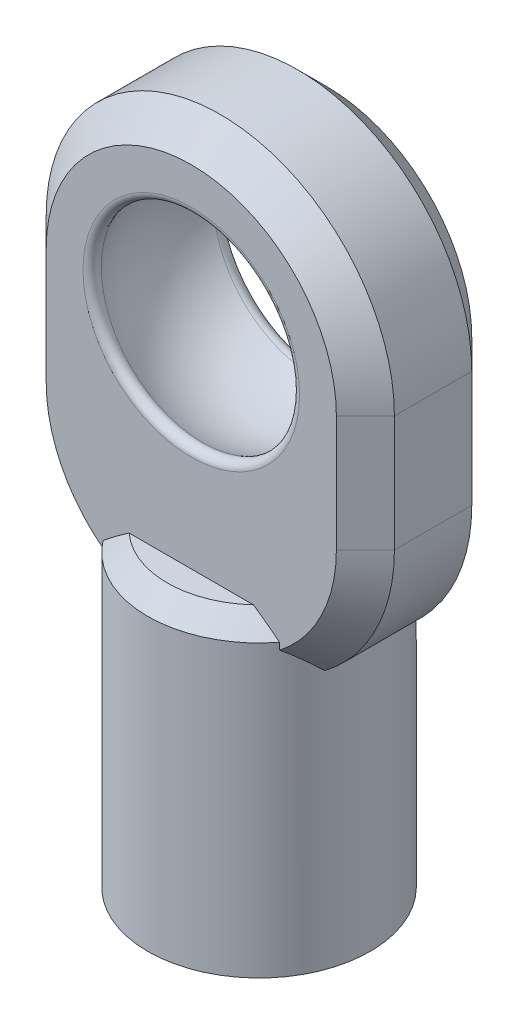
ISO-10303-21;
HEADER;
FILE_DESCRIPTION(('STEP AP214'),'2;1');
FILE_NAME('part.step','',(''),(''),'','','');
FILE_SCHEMA(('AUTOMOTIVE_DESIGN { 1 0 10303 214 1 1 1 1 }'));
ENDSEC;
DATA;
#1=APPLICATION_CONTEXT('core data for automotive mechanical design processes');
#2=APPLICATION_PROTOCOL_DEFINITION('international standard','automotive_design',2000,#1);
#3=PRODUCT_CONTEXT('',#1,'mechanical');
#4=PRODUCT('Part','Part','',(#3));
#5=PRODUCT_RELATED_PRODUCT_CATEGORY('part','',(#4));
#6=PRODUCT_DEFINITION_FORMATION('','',#4);
#7=PRODUCT_DEFINITION_CONTEXT('part definition',#1,'design');
#8=PRODUCT_DEFINITION('design','',#6,#7);
#9=PRODUCT_DEFINITION_SHAPE('','',#8);
#10=(LENGTH_UNIT() NAMED_UNIT(*) SI_UNIT(.MILLI.,.METRE.));
#11=(NAMED_UNIT(*) PLANE_ANGLE_UNIT() SI_UNIT($,.RADIAN.));
#12=(NAMED_UNIT(*) SI_UNIT($,.STERADIAN.) SOLID_ANGLE_UNIT());
#13=UNCERTAINTY_MEASURE_WITH_UNIT(LENGTH_MEASURE(1.E-05),#10,'distance_accuracy_value','');
#14=(GEOMETRIC_REPRESENTATION_CONTEXT(3) GLOBAL_UNCERTAINTY_ASSIGNED_CONTEXT((#13)) GLOBAL_UNIT_ASSIGNED_CONTEXT((#10,
#11,#12)) REPRESENTATION_CONTEXT('',''));
#15=CARTESIAN_POINT('',(0.,0.,0.));
#16=DIRECTION('',(0.,0.,1.));
#17=DIRECTION('',(1.,0.,0.));
#18=AXIS2_PLACEMENT_3D('',#15,#16,#17);
#19=CARTESIAN_POINT('',(0.,13.3,1.75));
#20=DIRECTION('',(0.,0.,-1.));
#21=DIRECTION('',(-1.,0.,0.));
#22=AXIS2_PLACEMENT_3D('',#19,#20,#21);
#23=PLANE('',#22);
#24=CARTESIAN_POINT('',(0.,13.3,1.75));
#25=DIRECTION('',(0.,0.,-1.));
#26=DIRECTION('',(-1.,0.,0.));
#27=AXIS2_PLACEMENT_3D('',#24,#25,#26);
#28=CIRCLE('',#27,2.79955353583388);
#29=CARTESIAN_POINT('',(-2.79955353583388,13.3,1.75));
#30=VERTEX_POINT('',#29);
#31=EDGE_CURVE('E11',#30,#30,#28,.T.);
#32=ORIENTED_EDGE('',*,*,#31,.T.);
#33=EDGE_LOOP('',(#32));
#34=FACE_BOUND('',#33,.T.);
#35=DIRECTION('',(-1.,0.,0.));
#36=VECTOR('',#35,1.);
#37=CARTESIAN_POINT('',(0.,8.,1.75));
#38=LINE('',#37,#36);
#39=CARTESIAN_POINT('',(1.60565407233314,8.,1.75));
#40=VERTEX_POINT('',#39);
#41=CARTESIAN_POINT('',(-1.60565407233314,8.,1.75));
#42=VERTEX_POINT('',#41);
#43=EDGE_CURVE('E265',#40,#42,#38,.T.);
#44=ORIENTED_EDGE('',*,*,#43,.F.);
#45=CARTESIAN_POINT('',(1.60565407233314,8.,1.75));
#46=CARTESIAN_POINT('',(1.6636905404126,7.96074798782015,1.75));
#47=CARTESIAN_POINT('',(1.72119958848667,7.92072909127485,1.75));
#48=CARTESIAN_POINT('',(1.8352846834103,7.8394231765944,1.75));
#49=CARTESIAN_POINT('',(1.89186105440925,7.79813661394961,1.75));
#50=CARTESIAN_POINT('',(2.00423804486126,7.71453695067654,1.75));
#51=CARTESIAN_POINT('',(2.06003874129001,7.67222395306929,1.75));
#52=CARTESIAN_POINT('',(2.17099756657291,7.58672257365775,1.75));
#53=CARTESIAN_POINT('',(2.22615546077587,7.543533887035,1.75));
#54=CARTESIAN_POINT('',(2.28103594886183,7.5,1.75));
#55=B_SPLINE_CURVE_WITH_KNOTS('',3,(#45,#46,#47,#48,#49,#50,#51,#52,#53,#54),.UNSPECIFIED.,.F.,
.F.,(4,2,2,2,4),(0.,0.210175172360645,0.420275689770245,0.630355206391822,0.840509149543498),.UNSPECIFIED.);
#56=CARTESIAN_POINT('',(2.28103594886183,7.5,1.75));
#57=VERTEX_POINT('',#56);
#58=EDGE_CURVE('E39',#40,#57,#55,.T.);
#59=ORIENTED_EDGE('',*,*,#58,.T.);
#60=DIRECTION('',(0.,-1.,0.));
#61=VECTOR('',#60,1.);
#62=CARTESIAN_POINT('',(2.28103594886183,8.,1.75));
#63=LINE('',#62,#61);
#64=CARTESIAN_POINT('',(2.28103594886183,7.32352977505233,1.75));
#65=VERTEX_POINT('',#64);
#66=EDGE_CURVE('E340',#57,#65,#63,.T.);
#67=ORIENTED_EDGE('',*,*,#66,.T.);
#68=CARTESIAN_POINT('',(0.,10.3,1.75));
#69=DIRECTION('',(0.,0.,-1.));
#70=DIRECTION('',(-1.,0.,0.));
#71=AXIS2_PLACEMENT_3D('',#68,#69,#70);
#72=CIRCLE('',#71,3.75);
#73=CARTESIAN_POINT('',(3.75,10.3,1.75));
#74=VERTEX_POINT('',#73);
#75=EDGE_CURVE('E159',#65,#74,#72,.F.);
#76=ORIENTED_EDGE('',*,*,#75,.T.);
#77=DIRECTION('',(0.,1.,0.));
#78=VECTOR('',#77,1.);
#79=CARTESIAN_POINT('',(3.75,13.3,1.75));
#80=LINE('',#79,#78);
#81=CARTESIAN_POINT('',(3.75,13.3,1.75));
#82=VERTEX_POINT('',#81);
#83=EDGE_CURVE('E300',#74,#82,#80,.T.);
#84=ORIENTED_EDGE('',*,*,#83,.T.);
#85=CARTESIAN_POINT('',(0.,13.3,1.75));
#86=DIRECTION('',(0.,0.,-1.));
#87=DIRECTION('',(-1.,0.,0.));
#88=AXIS2_PLACEMENT_3D('',#85,#86,#87);
#89=CIRCLE('',#88,3.75);
#90=CARTESIAN_POINT('',(-3.75,13.3,1.75));
#91=VERTEX_POINT('',#90);
#92=EDGE_CURVE('E296',#82,#91,#89,.F.);
#93=ORIENTED_EDGE('',*,*,#92,.T.);
#94=DIRECTION('',(0.,-1.,0.));
#95=VECTOR('',#94,1.);
#96=CARTESIAN_POINT('',(-3.75,13.3,1.75));
#97=LINE('',#96,#95);
#98=CARTESIAN_POINT('',(-3.75,10.3,1.75));
#99=VERTEX_POINT('',#98);
#100=EDGE_CURVE('E298',#91,#99,#97,.T.);
#101=ORIENTED_EDGE('',*,*,#100,.T.);
#102=CARTESIAN_POINT('',(0.,10.3,1.75));
#103=DIRECTION('',(0.,0.,-1.));
#104=DIRECTION('',(-1.,0.,0.));
#105=AXIS2_PLACEMENT_3D('',#102,#103,#104);
#106=CIRCLE('',#105,3.75);
#107=CARTESIAN_POINT('',(-2.28103594886183,7.32352977505233,1.75));
#108=VERTEX_POINT('',#107);
#109=EDGE_CURVE('E302',#99,#108,#106,.F.);
#110=ORIENTED_EDGE('',*,*,#109,.T.);
#111=DIRECTION('',(0.,-1.,0.));
#112=VECTOR('',#111,1.);
#113=CARTESIAN_POINT('',(-2.28103594886183,8.,1.75));
#114=LINE('',#113,#112);
#115=CARTESIAN_POINT('',(-2.28103594886183,7.5,1.75));
#116=VERTEX_POINT('',#115);
#117=EDGE_CURVE('E344',#108,#116,#114,.F.);
#118=ORIENTED_EDGE('',*,*,#117,.T.);
#119=CARTESIAN_POINT('',(-2.28103594886183,7.5,1.75));
#120=CARTESIAN_POINT('',(-2.22615546077587,7.543533887035,1.75));
#121=CARTESIAN_POINT('',(-2.17099756657291,7.58672257365775,1.75));
#122=CARTESIAN_POINT('',(-2.06003874129001,7.67222395306929,1.75));
#123=CARTESIAN_POINT('',(-2.00423804486126,7.71453695067654,1.75));
#124=CARTESIAN_POINT('',(-1.89186105440925,7.79813661394961,1.75));
#125=CARTESIAN_POINT('',(-1.8352846834103,7.8394231765944,1.75));
#126=CARTESIAN_POINT('',(-1.72119958848667,7.92072909127485,1.75));
#127=CARTESIAN_POINT('',(-1.6636905404126,7.96074798782015,1.75));
#128=CARTESIAN_POINT('',(-1.60565407233314,8.,1.75));
#129=B_SPLINE_CURVE_WITH_KNOTS('',3,(#119,#120,#121,#122,#123,#124,#125,#126,#127,#128),
.UNSPECIFIED.,.F.,.F.,(4,2,2,2,4),(0.,0.210153943151676,0.420233459773253,0.630333977182853,
0.840509149543498),.UNSPECIFIED.);
#130=EDGE_CURVE('E31',#116,#42,#129,.T.);
#131=ORIENTED_EDGE('',*,*,#130,.T.);
#132=EDGE_LOOP('',(#44,#59,#67,#76,#84,#93,#101,#110,#118,#131));
#133=FACE_BOUND('',#132,.T.);
#134=ADVANCED_FACE('F16',(#34,#133),#23,.F.);
#135=CARTESIAN_POINT('',(0.,13.3,-1.75));
#136=DIRECTION('',(0.,0.,-1.));
#137=DIRECTION('',(-1.,0.,0.));
#138=AXIS2_PLACEMENT_3D('',#135,#136,#137);
#139=PLANE('',#138);
#140=CARTESIAN_POINT('',(0.,13.3,-1.75));
#141=DIRECTION('',(0.,0.,-1.));
#142=DIRECTION('',(-1.,0.,0.));
#143=AXIS2_PLACEMENT_3D('',#140,#141,#142);
#144=CIRCLE('',#143,2.79955353583388);
#145=CARTESIAN_POINT('',(-2.79955353583388,13.3,-1.75));
#146=VERTEX_POINT('',#145);
#147=EDGE_CURVE('E448',#146,#146,#144,.F.);
#148=ORIENTED_EDGE('',*,*,#147,.T.);
#149=EDGE_LOOP('',(#148));
#150=FACE_BOUND('',#149,.T.);
#151=DIRECTION('',(0.,-1.,0.));
#152=VECTOR('',#151,1.);
#153=CARTESIAN_POINT('',(3.75,10.3,-1.75));
#154=LINE('',#153,#152);
#155=CARTESIAN_POINT('',(3.75,13.3,-1.75));
#156=VERTEX_POINT('',#155);
#157=CARTESIAN_POINT('',(3.75,10.3,-1.75));
#158=VERTEX_POINT('',#157);
#159=EDGE_CURVE('E273',#156,#158,#154,.T.);
#160=ORIENTED_EDGE('',*,*,#159,.T.);
#161=CARTESIAN_POINT('',(0.,10.3,-1.75));
#162=DIRECTION('',(0.,0.,-1.));
#163=DIRECTION('',(-1.,0.,0.));
#164=AXIS2_PLACEMENT_3D('',#161,#162,#163);
#165=CIRCLE('',#164,3.75);
#166=CARTESIAN_POINT('',(2.28103594886183,7.32352977505234,-1.75));
#167=VERTEX_POINT('',#166);
#168=EDGE_CURVE('E277',#158,#167,#165,.T.);
#169=ORIENTED_EDGE('',*,*,#168,.T.);
#170=DIRECTION('',(0.,-1.,0.));
#171=VECTOR('',#170,1.);
#172=CARTESIAN_POINT('',(2.28103594886183,8.,-1.75));
#173=LINE('',#172,#171);
#174=CARTESIAN_POINT('',(2.28103594886183,7.5,-1.75));
#175=VERTEX_POINT('',#174);
#176=EDGE_CURVE('E346',#175,#167,#173,.T.);
#177=ORIENTED_EDGE('',*,*,#176,.F.);
#178=CARTESIAN_POINT('',(2.28103594886183,7.5,-1.75));
#179=CARTESIAN_POINT('',(2.22615546077587,7.543533887035,-1.75));
#180=CARTESIAN_POINT('',(2.17099756657291,7.58672257365775,-1.75));
#181=CARTESIAN_POINT('',(2.06003874129001,7.67222395306929,-1.75));
#182=CARTESIAN_POINT('',(2.00423804486126,7.71453695067654,-1.75));
#183=CARTESIAN_POINT('',(1.89186105440925,7.79813661394961,-1.75));
#184=CARTESIAN_POINT('',(1.8352846834103,7.8394231765944,-1.75));
#185=CARTESIAN_POINT('',(1.72119958848667,7.92072909127485,-1.75));
#186=CARTESIAN_POINT('',(1.6636905404126,7.96074798782015,-1.75));
#187=CARTESIAN_POINT('',(1.60565407233314,8.,-1.75));
#188=B_SPLINE_CURVE_WITH_KNOTS('',3,(#178,#179,#180,#181,#182,#183,#184,#185,#186,#187),
.UNSPECIFIED.,.F.,.F.,(4,2,2,2,4),(0.,0.210153943151676,0.420233459773253,0.630333977182853,
0.840509149543498),.UNSPECIFIED.);
#189=CARTESIAN_POINT('',(1.60565407233314,8.,-1.75));
#190=VERTEX_POINT('',#189);
#191=EDGE_CURVE('E227',#175,#190,#188,.T.);
#192=ORIENTED_EDGE('',*,*,#191,.T.);
#193=DIRECTION('',(-1.,0.,0.));
#194=VECTOR('',#193,1.);
#195=CARTESIAN_POINT('',(0.,8.,-1.75));
#196=LINE('',#195,#194);
#197=CARTESIAN_POINT('',(-1.60565407233314,8.,-1.75));
#198=VERTEX_POINT('',#197);
#199=EDGE_CURVE('E334',#190,#198,#196,.T.);
#200=ORIENTED_EDGE('',*,*,#199,.T.);
#201=CARTESIAN_POINT('',(-1.60565407233314,8.,-1.75));
#202=CARTESIAN_POINT('',(-1.6636905404126,7.96074798782015,-1.75));
#203=CARTESIAN_POINT('',(-1.72119958848667,7.92072909127485,-1.75));
#204=CARTESIAN_POINT('',(-1.8352846834103,7.8394231765944,-1.75));
#205=CARTESIAN_POINT('',(-1.89186105440925,7.79813661394961,-1.75));
#206=CARTESIAN_POINT('',(-2.00423804486126,7.71453695067654,-1.75));
#207=CARTESIAN_POINT('',(-2.06003874129001,7.67222395306929,-1.75));
#208=CARTESIAN_POINT('',(-2.17099756657291,7.58672257365775,-1.75));
#209=CARTESIAN_POINT('',(-2.22615546077587,7.543533887035,-1.75));
#210=CARTESIAN_POINT('',(-2.28103594886183,7.5,-1.75));
#211=B_SPLINE_CURVE_WITH_KNOTS('',3,(#201,#202,#203,#204,#205,#206,#207,#208,#209,#210),
.UNSPECIFIED.,.F.,.F.,(4,2,2,2,4),(0.,0.210175172360645,0.420275689770245,0.630355206391822,
0.840509149543498),.UNSPECIFIED.);
#212=CARTESIAN_POINT('',(-2.28103594886183,7.5,-1.75));
#213=VERTEX_POINT('',#212);
#214=EDGE_CURVE('E219',#198,#213,#211,.T.);
#215=ORIENTED_EDGE('',*,*,#214,.T.);
#216=DIRECTION('',(0.,-1.,0.));
#217=VECTOR('',#216,1.);
#218=CARTESIAN_POINT('',(-2.28103594886183,8.,-1.75));
#219=LINE('',#218,#217);
#220=CARTESIAN_POINT('',(-2.28103594886183,7.32352977505234,-1.75));
#221=VERTEX_POINT('',#220);
#222=EDGE_CURVE('E348',#221,#213,#219,.F.);
#223=ORIENTED_EDGE('',*,*,#222,.F.);
#224=CARTESIAN_POINT('',(0.,10.3,-1.75));
#225=DIRECTION('',(0.,0.,-1.));
#226=DIRECTION('',(-1.,0.,0.));
#227=AXIS2_PLACEMENT_3D('',#224,#225,#226);
#228=CIRCLE('',#227,3.75);
#229=CARTESIAN_POINT('',(-3.75,10.3,-1.75));
#230=VERTEX_POINT('',#229);
#231=EDGE_CURVE('E275',#221,#230,#228,.T.);
#232=ORIENTED_EDGE('',*,*,#231,.T.);
#233=DIRECTION('',(0.,1.,0.));
#234=VECTOR('',#233,1.);
#235=CARTESIAN_POINT('',(-3.75,13.3,-1.75));
#236=LINE('',#235,#234);
#237=CARTESIAN_POINT('',(-3.75,13.3,-1.75));
#238=VERTEX_POINT('',#237);
#239=EDGE_CURVE('E271',#230,#238,#236,.T.);
#240=ORIENTED_EDGE('',*,*,#239,.T.);
#241=CARTESIAN_POINT('',(0.,13.3,-1.75));
#242=DIRECTION('',(0.,0.,-1.));
#243=DIRECTION('',(-1.,0.,0.));
#244=AXIS2_PLACEMENT_3D('',#241,#242,#243);
#245=CIRCLE('',#244,3.75);
#246=EDGE_CURVE('E269',#238,#156,#245,.T.);
#247=ORIENTED_EDGE('',*,*,#246,.T.);
#248=EDGE_LOOP('',(#160,#169,#177,#192,#200,#215,#223,#232,#240,#247));
#249=FACE_BOUND('',#248,.T.);
#250=ADVANCED_FACE('F239',(#150,#249),#139,.T.);
#251=CARTESIAN_POINT('',(0.,8.,0.));
#252=DIRECTION('',(0.,-1.,0.));
#253=DIRECTION('',(0.,0.,-1.));
#254=AXIS2_PLACEMENT_3D('',#251,#252,#253);
#255=CYLINDRICAL_SURFACE('',#254,2.875);
#256=CARTESIAN_POINT('',(0.,0.,0.));
#257=DIRECTION('',(0.,1.,0.));
#258=DIRECTION('',(0.,0.,1.));
#259=AXIS2_PLACEMENT_3D('',#256,#257,#258);
#260=CIRCLE('',#259,2.875);
#261=CARTESIAN_POINT('',(0.,0.,2.875));
#262=VERTEX_POINT('',#261);
#263=EDGE_CURVE('E336',#262,#262,#260,.T.);
#264=ORIENTED_EDGE('',*,*,#263,.T.);
#265=EDGE_LOOP('',(#264));
#266=FACE_BOUND('',#265,.T.);
#267=ORIENTED_EDGE('',*,*,#222,.T.);
#268=CARTESIAN_POINT('',(0.,7.5,0.));
#269=DIRECTION('',(0.,1.,0.));
#270=DIRECTION('',(0.,0.,1.));
#271=AXIS2_PLACEMENT_3D('',#268,#269,#270);
#272=CIRCLE('',#271,2.875);
#273=EDGE_CURVE('E388',#213,#175,#272,.F.);
#274=ORIENTED_EDGE('',*,*,#273,.T.);
#275=ORIENTED_EDGE('',*,*,#176,.T.);
#276=CARTESIAN_POINT('',(2.28103594886183,7.32352977505234,-1.75));
#277=CARTESIAN_POINT('',(2.32903034728948,7.28151051131453,-1.68741791204875));
#278=CARTESIAN_POINT('',(2.37328169171649,7.23610053107443,-1.62443476057036));
#279=CARTESIAN_POINT('',(2.45459462764211,7.14005313428521,-1.49872234599357));
#280=CARTESIAN_POINT('',(2.4917072056913,7.08945707309523,-1.43599467448323));
#281=CARTESIAN_POINT('',(2.5597160304527,6.98395950423892,-1.3109351174366));
#282=CARTESIAN_POINT('',(2.59061558653138,6.92906031041116,-1.24860303841497));
#283=CARTESIAN_POINT('',(2.64704023394056,6.81541971728852,-1.12404553628687));
#284=CARTESIAN_POINT('',(2.67252336655329,6.75665263498348,-1.06182440361426));
#285=CARTESIAN_POINT('',(2.69548233160598,6.69661617365009,-1.00000000000001));
#286=B_SPLINE_CURVE_WITH_KNOTS('',3,(#276,#277,#278,#279,#280,#281,#282,#283,#284,#285),
.UNSPECIFIED.,.F.,.F.,(4,2,2,2,4),(0.,0.267750662814851,0.533511545629209,0.799130493698821,
1.0667375856942),.UNSPECIFIED.);
#287=CARTESIAN_POINT('',(2.69548233160597,6.69661617365011,-1.));
#288=VERTEX_POINT('',#287);
#289=EDGE_CURVE('E154',#167,#288,#286,.T.);
#290=ORIENTED_EDGE('',*,*,#289,.T.);
#291=CARTESIAN_POINT('',(0.,5.8,-2.875));
#292=CARTESIAN_POINT('',(-0.072783523169878,5.80000030922166,-2.87499961175002));
#293=CARTESIAN_POINT('',(-0.145567220425323,5.80177122285278,-2.87223062394587));
#294=CARTESIAN_POINT('',(-0.290556996482285,5.80880189446486,-2.86120601355759));
#295=CARTESIAN_POINT('',(-0.362762838020173,5.81406301789364,-2.85294824363719));
#296=CARTESIAN_POINT('',(-0.57782274021172,5.83493670836804,-2.82005846425032));
#297=CARTESIAN_POINT('',(-0.719047361576133,5.85563942448649,-2.78731013041155));
#298=CARTESIAN_POINT('',(-0.992179546871018,5.90854130427657,-2.70215271669372));
#299=CARTESIAN_POINT('',(-1.12412963274393,5.940683255834,-2.64984141395222));
#300=CARTESIAN_POINT('',(-1.37692140751837,6.01381249661062,-2.5277298017559));
#301=CARTESIAN_POINT('',(-1.49776379965105,6.05479922531377,-2.45793060050861));
#302=CARTESIAN_POINT('',(-1.73602849298218,6.1462312965824,-2.29656384213841));
#303=CARTESIAN_POINT('',(-1.85236625734969,6.19717564764517,-2.20368438130797));
#304=CARTESIAN_POINT('',(-2.06886112414408,6.30196168765764,-2.00184482407391));
#305=CARTESIAN_POINT('',(-2.16899547570021,6.35580731131685,-1.89286252151021));
#306=CARTESIAN_POINT('',(-2.3648106840894,6.46956591658209,-1.64373952364569));
#307=CARTESIAN_POINT('',(-2.45781490160236,6.52924765579964,-1.50137176093634));
#308=CARTESIAN_POINT('',(-2.61835083821353,6.63889246386321,-1.19956173450048));
#309=CARTESIAN_POINT('',(-2.6859262147841,6.68887211761569,-1.0401493438415));
#310=CARTESIAN_POINT('',(-2.77777075196665,6.75932221766743,-0.752258481175665));
#311=CARTESIAN_POINT('',(-2.80880055786868,6.78411447522051,-0.627002680309728));
#312=CARTESIAN_POINT('',(-2.85380928486408,6.82054066648165,-0.371671401292367));
#313=CARTESIAN_POINT('',(-2.8678139825787,6.83219449029945,-0.24160351727191));
#314=CARTESIAN_POINT('',(-2.87791906654415,6.84057288802744,0.0201269828597444));
#315=CARTESIAN_POINT('',(-2.87396476288532,6.83725185977218,0.151793250785191));
#316=CARTESIAN_POINT('',(-2.84830485666035,6.8161208747879,0.412237283436869));
#317=CARTESIAN_POINT('',(-2.82658463505384,6.79829898579939,0.541012579573646));
#318=CARTESIAN_POINT('',(-2.76757842431845,6.75149940807402,0.788593478203871));
#319=CARTESIAN_POINT('',(-2.73076620573821,6.72286319368277,0.907580502830963));
#320=CARTESIAN_POINT('',(-2.64311081076683,6.65761841239533,1.13788908276229));
#321=CARTESIAN_POINT('',(-2.59226296728761,6.62100719452786,1.24920807290059));
#322=CARTESIAN_POINT('',(-2.46672585009473,6.53541805423647,1.4838638175269));
#323=CARTESIAN_POINT('',(-2.38932976472954,6.48541685841557,1.60537753316993));
#324=CARTESIAN_POINT('',(-2.21781887688206,6.38320671573636,1.83507032258256));
#325=CARTESIAN_POINT('',(-2.1236843135376,6.33099521559534,1.94323337649539));
#326=CARTESIAN_POINT('',(-1.90133472442453,6.21918218321593,2.16315110067774));
#327=CARTESIAN_POINT('',(-1.77003507738028,6.1599539936009,2.27201097212883));
#328=CARTESIAN_POINT('',(-1.48773483963491,6.05035380043621,2.46607253761964));
#329=CARTESIAN_POINT('',(-1.33675563346786,5.99997232122018,2.55129960203093));
#330=CARTESIAN_POINT('',(-1.0500254783981,5.92222087048815,2.68004511622704));
#331=CARTESIAN_POINT('',(-0.917182870330803,5.89226946429493,2.7284814408347));
#332=CARTESIAN_POINT('',(-0.643849672609249,5.84414336798664,2.80556567346886));
#333=CARTESIAN_POINT('',(-0.503365312407664,5.82595923680335,2.83422944654301));
#334=CARTESIAN_POINT('',(-0.21810533309283,5.80300513370976,2.87032840529018));
#335=CARTESIAN_POINT('',(-0.0733170775482418,5.79827964727739,2.87769319167565));
#336=CARTESIAN_POINT('',(0.215503368648077,5.80284358623196,2.87054854458038));
#337=CARTESIAN_POINT('',(0.359535510913918,5.81213389781945,2.85603772793396));
#338=CARTESIAN_POINT('',(0.634902797272584,5.84297121569541,2.80732227706115));
#339=CARTESIAN_POINT('',(0.766507602654549,5.86384945297772,2.7741910603863));
#340=CARTESIAN_POINT('',(1.02195663356298,5.91564060245869,2.69059582301355));
#341=CARTESIAN_POINT('',(1.14579954921447,5.94655520295532,2.64012888605064));
#342=CARTESIAN_POINT('',(1.39242947238269,6.0187774742719,2.51932773311512));
#343=CARTESIAN_POINT('',(1.51444656456113,6.06068899658173,2.44779105129279));
#344=CARTESIAN_POINT('',(1.74533689007864,6.15040095072684,2.28890736327487));
#345=CARTESIAN_POINT('',(1.85419973072732,6.19820597934193,2.2015479905621));
#346=CARTESIAN_POINT('',(2.07311528583371,6.30386293425054,1.99835052455742));
#347=CARTESIAN_POINT('',(2.18082365209975,6.36213608647912,1.8802014211844));
#348=CARTESIAN_POINT('',(2.37570391765677,6.47654595155689,1.62701350008498));
#349=CARTESIAN_POINT('',(2.46287216726046,6.53268228323984,1.49197168727979));
#350=CARTESIAN_POINT('',(2.60405235932289,6.62914364668516,1.2263497445554));
#351=CARTESIAN_POINT('',(2.66098071931978,6.67058160774178,1.09772881391766));
#352=CARTESIAN_POINT('',(2.75600718560701,6.74219069933667,0.830675272526152));
#353=CARTESIAN_POINT('',(2.79413154757125,6.77237752514468,0.692256652890159));
#354=CARTESIAN_POINT('',(2.83574184896069,6.80588014177883,0.479097021242113));
#355=CARTESIAN_POINT('',(2.84703353373614,6.81510168328843,0.406724386326678));
#356=CARTESIAN_POINT('',(2.86407444163803,6.82909169930997,0.260917512274768));
#357=CARTESIAN_POINT('',(2.86982650924283,6.83386245916642,0.187483837643333));
#358=CARTESIAN_POINT('',(2.87566153477805,6.83870171395514,0.0402597393013018));
#359=CARTESIAN_POINT('',(2.87574642744288,6.83877181366037,-0.0335305540582709));
#360=CARTESIAN_POINT('',(2.87026014496542,6.83422244946878,-0.180732061934813));
#361=CARTESIAN_POINT('',(2.86468940686338,6.82960334793112,-0.254143305302392));
#362=CARTESIAN_POINT('',(2.84202546020242,6.81097919143464,-0.451982210408418));
#363=CARTESIAN_POINT('',(2.81954680457287,6.7926286609797,-0.575435795958103));
#364=CARTESIAN_POINT('',(2.75946071197948,6.74517089709208,-0.816388638553746));
#365=CARTESIAN_POINT('',(2.72183840347028,6.71605309214845,-0.933881914298495));
#366=CARTESIAN_POINT('',(2.61751645461703,6.63883524194717,-1.20049324280958));
#367=CARTESIAN_POINT('',(2.54526386654483,6.58765181090625,-1.34654884636546));
#368=CARTESIAN_POINT('',(2.37869318523325,6.4787801791244,-1.62281929088489));
#369=CARTESIAN_POINT('',(2.28434535125803,6.42108326577846,-1.75301241828551));
#370=CARTESIAN_POINT('',(2.07426627867565,6.30474966140867,-1.99732196747395));
#371=CARTESIAN_POINT('',(1.9583000882002,6.24610982437209,-2.11123477874339));
#372=CARTESIAN_POINT('',(1.70713901908201,6.13412398982064,-2.31900857227349));
#373=CARTESIAN_POINT('',(1.57194390256329,6.08077805780913,-2.41286930643924));
#374=CARTESIAN_POINT('',(1.35441691026848,6.00795160185813,-2.53741352306659));
#375=CARTESIAN_POINT('',(1.27818838011973,5.98458112973753,-2.57668065058184));
#376=CARTESIAN_POINT('',(1.12172705505361,5.94129609491709,-2.64853761436864));
#377=CARTESIAN_POINT('',(1.04149657635943,5.92137956237698,-2.6811312585697));
#378=CARTESIAN_POINT('',(0.877806832159255,5.8856531083073,-2.73908778333709));
#379=CARTESIAN_POINT('',(0.794355899605973,5.86983331063993,-2.76446806808566));
#380=CARTESIAN_POINT('',(0.624837008777705,5.84276597257219,-2.80764028504336));
#381=CARTESIAN_POINT('',(0.538770934407653,5.83151522087834,-2.82543754731354));
#382=CARTESIAN_POINT('',(0.377394452599026,5.81522853263048,-2.85111953090061));
#383=CARTESIAN_POINT('',(0.302317145221523,5.80953154241339,-2.86006167407401));
#384=CARTESIAN_POINT('',(0.151493299158573,5.8019170681305,-2.8720021846636));
#385=CARTESIAN_POINT('',(0.0757467438538565,5.79999967818907,-2.87500040405672));
#386=CARTESIAN_POINT('',(0.,5.8,-2.875));
#387=B_SPLINE_CURVE_WITH_KNOTS('',3,(#291,#292,#293,#294,#295,#296,#297,#298,#299,#300,#301,
#302,#303,#304,#305,#306,#307,#308,#309,#310,#311,#312,#313,#314,#315,#316,#317,#318,#319,#320,
#321,#322,#323,#324,#325,#326,#327,#328,#329,#330,#331,#332,#333,#334,#335,#336,#337,#338,#339,
#340,#341,#342,#343,#344,#345,#346,#347,#348,#349,#350,#351,#352,#353,#354,#355,#356,#357,#358,
#359,#360,#361,#362,#363,#364,#365,#366,#367,#368,#369,#370,#371,#372,#373,#374,#375,#376,#377,
#378,#379,#380,#381,#382,#383,#384,#385,#386),.UNSPECIFIED.,.T.,.F.,(4,2,2,2,2,2,2,2,2,2,2,2,2,
2,2,2,2,2,2,2,2,2,2,2,2,2,2,2,2,2,2,2,2,2,2,2,2,2,2,2,2,2,2,2,2,2,2,4),(0.,0.218269111694936,
0.436623665526065,0.873545163201601,1.3083114634851,1.74305021960811,2.21327908045486,
2.68416255588437,3.22227047508345,3.75945028310311,4.15204396437959,4.54404250154968,
4.93723557702123,5.33075252514995,5.71276170067376,6.09489805419345,6.55073665196195,
7.00711701366506,7.5461195633416,8.08454122104886,8.51630046748152,8.94771287583803,
9.38054960583508,9.81341370467855,10.2235627066845,10.6337807389585,11.0746417307357,
11.515848784216,12.0242580312123,12.5327575473125,12.9710349387647,13.4086986268866,
13.6298813602296,13.8509504601832,14.071944088286,14.2929206403525,14.6715718967568,
15.0505959114099,15.5602939360447,16.0706820103192,16.5869799464227,17.1032842700678,
17.3695723445036,17.6357080472962,17.9011960661079,18.1664971658972,18.3936469665699,
18.6208024239414),.UNSPECIFIED.);
#388=CARTESIAN_POINT('',(2.69548233160597,6.69661617365011,1.));
#389=VERTEX_POINT('',#388);
#390=EDGE_CURVE('E137',#389,#288,#387,.T.);
#391=ORIENTED_EDGE('',*,*,#390,.F.);
#392=CARTESIAN_POINT('',(2.69548233160597,6.69661617365011,1.));
#393=CARTESIAN_POINT('',(2.67252336655328,6.75665263498349,1.06182440361425));
#394=CARTESIAN_POINT('',(2.64704023394056,6.81541971728853,1.12404553628687));
#395=CARTESIAN_POINT('',(2.59061558653139,6.92906031041116,1.24860303841497));
#396=CARTESIAN_POINT('',(2.5597160304527,6.98395950423892,1.3109351174366));
#397=CARTESIAN_POINT('',(2.4917072056913,7.08945707309523,1.43599467448323));
#398=CARTESIAN_POINT('',(2.45459462764211,7.14005313428521,1.49872234599357));
#399=CARTESIAN_POINT('',(2.3732816917165,7.23610053107442,1.62443476057036));
#400=CARTESIAN_POINT('',(2.32903034728948,7.28151051131452,1.68741791204874));
#401=CARTESIAN_POINT('',(2.28103594886184,7.32352977505233,1.75));
#402=B_SPLINE_CURVE_WITH_KNOTS('',3,(#392,#393,#394,#395,#396,#397,#398,#399,#400,#401),
.UNSPECIFIED.,.F.,.F.,(4,2,2,2,4),(0.,0.267607091995378,0.533226040064986,0.798986922879342,
1.06673758569419),.UNSPECIFIED.);
#403=EDGE_CURVE('E151',#389,#65,#402,.T.);
#404=ORIENTED_EDGE('',*,*,#403,.T.);
#405=ORIENTED_EDGE('',*,*,#66,.F.);
#406=CARTESIAN_POINT('',(0.,7.5,0.));
#407=DIRECTION('',(0.,1.,0.));
#408=DIRECTION('',(0.,0.,1.));
#409=AXIS2_PLACEMENT_3D('',#406,#407,#408);
#410=CIRCLE('',#409,2.875);
#411=EDGE_CURVE('E386',#57,#116,#410,.F.);
#412=ORIENTED_EDGE('',*,*,#411,.T.);
#413=ORIENTED_EDGE('',*,*,#117,.F.);
#414=CARTESIAN_POINT('',(-2.28103594886183,7.32352977505233,1.75));
#415=CARTESIAN_POINT('',(-2.32903034728948,7.28151051131453,1.68741791204874));
#416=CARTESIAN_POINT('',(-2.3732816917165,7.23610053107443,1.62443476057036));
#417=CARTESIAN_POINT('',(-2.45459462764211,7.14005313428521,1.49872234599357));
#418=CARTESIAN_POINT('',(-2.4917072056913,7.08945707309523,1.43599467448323));
#419=CARTESIAN_POINT('',(-2.5597160304527,6.98395950423892,1.3109351174366));
#420=CARTESIAN_POINT('',(-2.59061558653139,6.92906031041116,1.24860303841497));
#421=CARTESIAN_POINT('',(-2.64704023394056,6.81541971728853,1.12404553628687));
#422=CARTESIAN_POINT('',(-2.67252336655329,6.75665263498348,1.06182440361426));
#423=CARTESIAN_POINT('',(-2.69548233160598,6.69661617365009,1.00000000000002));
#424=B_SPLINE_CURVE_WITH_KNOTS('',3,(#414,#415,#416,#417,#418,#419,#420,#421,#422,#423),
.UNSPECIFIED.,.F.,.F.,(4,2,2,2,4),(0.,0.26775066281485,0.533511545629207,0.799130493698818,
1.0667375856942),.UNSPECIFIED.);
#425=CARTESIAN_POINT('',(-2.69548233160597,6.69661617365011,1.));
#426=VERTEX_POINT('',#425);
#427=EDGE_CURVE('E160',#108,#426,#424,.T.);
#428=ORIENTED_EDGE('',*,*,#427,.T.);
#429=CARTESIAN_POINT('',(-2.69548233160598,6.69661617365011,-1.));
#430=VERTEX_POINT('',#429);
#431=EDGE_CURVE('E155',#430,#426,#387,.T.);
#432=ORIENTED_EDGE('',*,*,#431,.F.);
#433=CARTESIAN_POINT('',(-2.69548233160598,6.69661617365011,-1.));
#434=CARTESIAN_POINT('',(-2.67252336655328,6.75665263498348,-1.06182440361426));
#435=CARTESIAN_POINT('',(-2.64704023394055,6.81541971728853,-1.12404553628687));
#436=CARTESIAN_POINT('',(-2.59061558653138,6.92906031041116,-1.24860303841497));
#437=CARTESIAN_POINT('',(-2.5597160304527,6.98395950423892,-1.3109351174366));
#438=CARTESIAN_POINT('',(-2.4917072056913,7.08945707309523,-1.43599467448323));
#439=CARTESIAN_POINT('',(-2.45459462764211,7.14005313428521,-1.49872234599357));
#440=CARTESIAN_POINT('',(-2.37328169171649,7.23610053107443,-1.62443476057036));
#441=CARTESIAN_POINT('',(-2.32903034728948,7.28151051131453,-1.68741791204875));
#442=CARTESIAN_POINT('',(-2.28103594886184,7.32352977505234,-1.75));
#443=B_SPLINE_CURVE_WITH_KNOTS('',3,(#433,#434,#435,#436,#437,#438,#439,#440,#441,#442),
.UNSPECIFIED.,.F.,.F.,(4,2,2,2,4),(0.,0.267607091995379,0.53322604006499,0.798986922879347,
1.0667375856942),.UNSPECIFIED.);
#444=EDGE_CURVE('E161',#430,#221,#443,.T.);
#445=ORIENTED_EDGE('',*,*,#444,.T.);
#446=EDGE_LOOP('',(#267,#274,#275,#290,#391,#404,#405,#412,#413,#428,#432,#445));
#447=FACE_BOUND('',#446,.T.);
#448=ADVANCED_FACE('F149',(#266,#447),#255,.T.);
#449=CARTESIAN_POINT('',(0.,8.,0.));
#450=DIRECTION('',(0.,1.,0.));
#451=DIRECTION('',(0.,0.,1.));
#452=AXIS2_PLACEMENT_3D('',#449,#450,#451);
#453=PLANE('',#452);
#454=ORIENTED_EDGE('',*,*,#43,.T.);
#455=CARTESIAN_POINT('',(0.,8.,0.));
#456=DIRECTION('',(0.,1.,0.));
#457=DIRECTION('',(0.,0.,1.));
#458=AXIS2_PLACEMENT_3D('',#455,#456,#457);
#459=CIRCLE('',#458,2.375);
#460=EDGE_CURVE('E389',#42,#40,#459,.T.);
#461=ORIENTED_EDGE('',*,*,#460,.T.);
#462=EDGE_LOOP('',(#454,#461));
#463=FACE_BOUND('',#462,.T.);
#464=ADVANCED_FACE('F401',(#463),#453,.T.);
#465=ORIENTED_EDGE('',*,*,#199,.F.);
#466=CARTESIAN_POINT('',(0.,8.,0.));
#467=DIRECTION('',(0.,1.,0.));
#468=DIRECTION('',(0.,0.,1.));
#469=AXIS2_PLACEMENT_3D('',#466,#467,#468);
#470=CIRCLE('',#469,2.375);
#471=EDGE_CURVE('E163',#190,#198,#470,.T.);
#472=ORIENTED_EDGE('',*,*,#471,.T.);
#473=EDGE_LOOP('',(#465,#472));
#474=FACE_BOUND('',#473,.T.);
#475=ADVANCED_FACE('F399',(#474),#453,.T.);
#476=CARTESIAN_POINT('',(0.,0.,0.));
#477=DIRECTION('',(0.,1.,0.));
#478=DIRECTION('',(0.,0.,1.));
#479=AXIS2_PLACEMENT_3D('',#476,#477,#478);
#480=PLANE('',#479);
#481=CARTESIAN_POINT('',(0.,0.,0.));
#482=DIRECTION('',(0.,-1.,0.));
#483=DIRECTION('',(0.,0.,-1.));
#484=AXIS2_PLACEMENT_3D('',#481,#482,#483);
#485=CIRCLE('',#484,1.5);
#486=CARTESIAN_POINT('',(0.,0.,-1.5));
#487=VERTEX_POINT('',#486);
#488=EDGE_CURVE('E361',#487,#487,#485,.T.);
#489=ORIENTED_EDGE('',*,*,#488,.F.);
#490=EDGE_LOOP('',(#489));
#491=FACE_BOUND('',#490,.T.);
#492=ORIENTED_EDGE('',*,*,#263,.F.);
#493=EDGE_LOOP('',(#492));
#494=FACE_BOUND('',#493,.T.);
#495=ADVANCED_FACE('F257',(#491,#494),#480,.F.);
#496=CARTESIAN_POINT('',(0.,10.3,1.75));
#497=DIRECTION('',(0.,0.,-1.));
#498=DIRECTION('',(-1.,0.,0.));
#499=AXIS2_PLACEMENT_3D('',#496,#497,#498);
#500=CYLINDRICAL_SURFACE('',#499,4.5);
#501=DIRECTION('',(0.,0.,-1.));
#502=VECTOR('',#501,1.);
#503=CARTESIAN_POINT('',(-4.5,10.3,1.75));
#504=LINE('',#503,#502);
#505=CARTESIAN_POINT('',(-4.5,10.3,1.));
#506=VERTEX_POINT('',#505);
#507=CARTESIAN_POINT('',(-4.5,10.3,-1.));
#508=VERTEX_POINT('',#507);
#509=EDGE_CURVE('E353',#506,#508,#504,.T.);
#510=ORIENTED_EDGE('',*,*,#509,.T.);
#511=CARTESIAN_POINT('',(0.,10.3,-1.));
#512=DIRECTION('',(0.,0.,-1.));
#513=DIRECTION('',(-1.,0.,0.));
#514=AXIS2_PLACEMENT_3D('',#511,#512,#513);
#515=CIRCLE('',#514,4.5);
#516=EDGE_CURVE('E282',#508,#430,#515,.F.);
#517=ORIENTED_EDGE('',*,*,#516,.T.);
#518=ORIENTED_EDGE('',*,*,#431,.T.);
#519=CARTESIAN_POINT('',(0.,10.3,1.));
#520=DIRECTION('',(0.,0.,-1.));
#521=DIRECTION('',(-1.,0.,0.));
#522=AXIS2_PLACEMENT_3D('',#519,#520,#521);
#523=CIRCLE('',#522,4.5);
#524=EDGE_CURVE('E280',#426,#506,#523,.T.);
#525=ORIENTED_EDGE('',*,*,#524,.T.);
#526=EDGE_LOOP('',(#510,#517,#518,#525));
#527=FACE_BOUND('',#526,.T.);
#528=ADVANCED_FACE('F253',(#527),#500,.T.);
#529=ORIENTED_EDGE('',*,*,#390,.T.);
#530=CARTESIAN_POINT('',(0.,10.3,-1.));
#531=DIRECTION('',(0.,0.,-1.));
#532=DIRECTION('',(-1.,0.,0.));
#533=AXIS2_PLACEMENT_3D('',#530,#531,#532);
#534=CIRCLE('',#533,4.5);
#535=CARTESIAN_POINT('',(4.5,10.3,-1.));
#536=VERTEX_POINT('',#535);
#537=EDGE_CURVE('E144',#288,#536,#534,.F.);
#538=ORIENTED_EDGE('',*,*,#537,.T.);
#539=DIRECTION('',(0.,0.,-1.));
#540=VECTOR('',#539,1.);
#541=CARTESIAN_POINT('',(4.5,10.3,1.75));
#542=LINE('',#541,#540);
#543=CARTESIAN_POINT('',(4.5,10.3,1.));
#544=VERTEX_POINT('',#543);
#545=EDGE_CURVE('E140',#544,#536,#542,.T.);
#546=ORIENTED_EDGE('',*,*,#545,.F.);
#547=CARTESIAN_POINT('',(0.,10.3,1.));
#548=DIRECTION('',(0.,0.,-1.));
#549=DIRECTION('',(-1.,0.,0.));
#550=AXIS2_PLACEMENT_3D('',#547,#548,#549);
#551=CIRCLE('',#550,4.5);
#552=EDGE_CURVE('E133',#544,#389,#551,.T.);
#553=ORIENTED_EDGE('',*,*,#552,.T.);
#554=EDGE_LOOP('',(#529,#538,#546,#553));
#555=FACE_BOUND('',#554,.T.);
#556=ADVANCED_FACE('F135',(#555),#500,.T.);
#557=CARTESIAN_POINT('',(0.,13.3,1.75));
#558=DIRECTION('',(0.,0.,-1.));
#559=DIRECTION('',(-1.,0.,0.));
#560=AXIS2_PLACEMENT_3D('',#557,#558,#559);
#561=CYLINDRICAL_SURFACE('',#560,4.5);
#562=DIRECTION('',(0.,0.,-1.));
#563=VECTOR('',#562,1.);
#564=CARTESIAN_POINT('',(4.5,13.3,1.75));
#565=LINE('',#564,#563);
#566=CARTESIAN_POINT('',(4.5,13.3,1.));
#567=VERTEX_POINT('',#566);
#568=CARTESIAN_POINT('',(4.5,13.3,-1.));
#569=VERTEX_POINT('',#568);
#570=EDGE_CURVE('E357',#567,#569,#565,.T.);
#571=ORIENTED_EDGE('',*,*,#570,.T.);
#572=CARTESIAN_POINT('',(0.,13.3,-1.));
#573=DIRECTION('',(0.,0.,-1.));
#574=DIRECTION('',(-1.,0.,0.));
#575=AXIS2_PLACEMENT_3D('',#572,#573,#574);
#576=CIRCLE('',#575,4.5);
#577=CARTESIAN_POINT('',(-4.5,13.3,-1.));
#578=VERTEX_POINT('',#577);
#579=EDGE_CURVE('E294',#569,#578,#576,.F.);
#580=ORIENTED_EDGE('',*,*,#579,.T.);
#581=DIRECTION('',(0.,0.,-1.));
#582=VECTOR('',#581,1.);
#583=CARTESIAN_POINT('',(-4.5,13.3,1.75));
#584=LINE('',#583,#582);
#585=CARTESIAN_POINT('',(-4.5,13.3,1.));
#586=VERTEX_POINT('',#585);
#587=EDGE_CURVE('E350',#586,#578,#584,.T.);
#588=ORIENTED_EDGE('',*,*,#587,.F.);
#589=CARTESIAN_POINT('',(0.,13.3,1.));
#590=DIRECTION('',(0.,0.,-1.));
#591=DIRECTION('',(-1.,0.,0.));
#592=AXIS2_PLACEMENT_3D('',#589,#590,#591);
#593=CIRCLE('',#592,4.5);
#594=EDGE_CURVE('E292',#586,#567,#593,.T.);
#595=ORIENTED_EDGE('',*,*,#594,.T.);
#596=EDGE_LOOP('',(#571,#580,#588,#595));
#597=FACE_BOUND('',#596,.T.);
#598=ADVANCED_FACE('F408',(#597),#561,.T.);
#599=CARTESIAN_POINT('',(-4.5,13.3,1.75));
#600=DIRECTION('',(1.,0.,0.));
#601=DIRECTION('',(0.,0.,-1.));
#602=AXIS2_PLACEMENT_3D('',#599,#600,#601);
#603=PLANE('',#602);
#604=ORIENTED_EDGE('',*,*,#587,.T.);
#605=DIRECTION('',(0.,-1.,0.));
#606=VECTOR('',#605,1.);
#607=CARTESIAN_POINT('',(-4.5,10.3,-1.));
#608=LINE('',#607,#606);
#609=EDGE_CURVE('E290',#578,#508,#608,.T.);
#610=ORIENTED_EDGE('',*,*,#609,.T.);
#611=ORIENTED_EDGE('',*,*,#509,.F.);
#612=DIRECTION('',(0.,1.,0.));
#613=VECTOR('',#612,1.);
#614=CARTESIAN_POINT('',(-4.5,13.3,1.));
#615=LINE('',#614,#613);
#616=EDGE_CURVE('E288',#506,#586,#615,.T.);
#617=ORIENTED_EDGE('',*,*,#616,.T.);
#618=EDGE_LOOP('',(#604,#610,#611,#617));
#619=FACE_BOUND('',#618,.T.);
#620=ADVANCED_FACE('F251',(#619),#603,.F.);
#621=CARTESIAN_POINT('',(4.5,13.3,1.75));
#622=DIRECTION('',(-1.,0.,0.));
#623=DIRECTION('',(0.,0.,1.));
#624=AXIS2_PLACEMENT_3D('',#621,#622,#623);
#625=PLANE('',#624);
#626=ORIENTED_EDGE('',*,*,#545,.T.);
#627=DIRECTION('',(0.,1.,0.));
#628=VECTOR('',#627,1.);
#629=CARTESIAN_POINT('',(4.5,13.3,-1.));
#630=LINE('',#629,#628);
#631=EDGE_CURVE('E286',#536,#569,#630,.T.);
#632=ORIENTED_EDGE('',*,*,#631,.T.);
#633=ORIENTED_EDGE('',*,*,#570,.F.);
#634=DIRECTION('',(0.,-1.,0.));
#635=VECTOR('',#634,1.);
#636=CARTESIAN_POINT('',(4.5,13.3,1.));
#637=LINE('',#636,#635);
#638=EDGE_CURVE('E284',#567,#544,#637,.T.);
#639=ORIENTED_EDGE('',*,*,#638,.T.);
#640=EDGE_LOOP('',(#626,#632,#633,#639));
#641=FACE_BOUND('',#640,.T.);
#642=ADVANCED_FACE('F246',(#641),#625,.F.);
#643=CARTESIAN_POINT('',(0.,13.3,0.));
#644=DIRECTION('',(0.,0.,1.));
#645=DIRECTION('',(0.,1.,0.));
#646=AXIS2_PLACEMENT_3D('',#643,#644,#645);
#647=SPHERICAL_SURFACE('',#646,3.);
#648=CARTESIAN_POINT('',(0.,13.3,-1.453125));
#649=DIRECTION('',(0.,0.,1.));
#650=DIRECTION('',(1.,0.,0.));
#651=AXIS2_PLACEMENT_3D('',#648,#649,#650);
#652=CIRCLE('',#651,2.62458143984427);
#653=CARTESIAN_POINT('',(2.62458143984427,13.3,-1.453125));
#654=VERTEX_POINT('',#653);
#655=EDGE_CURVE('E24',#654,#654,#652,.F.);
#656=ORIENTED_EDGE('',*,*,#655,.T.);
#657=EDGE_LOOP('',(#656));
#658=FACE_BOUND('',#657,.T.);
#659=CARTESIAN_POINT('',(0.,13.3,1.453125));
#660=DIRECTION('',(0.,0.,-1.));
#661=DIRECTION('',(-1.,0.,0.));
#662=AXIS2_PLACEMENT_3D('',#659,#660,#661);
#663=CIRCLE('',#662,2.62458143984427);
#664=CARTESIAN_POINT('',(-2.62458143984427,13.3,1.453125));
#665=VERTEX_POINT('',#664);
#666=EDGE_CURVE('E450',#665,#665,#663,.F.);
#667=ORIENTED_EDGE('',*,*,#666,.T.);
#668=EDGE_LOOP('',(#667));
#669=FACE_BOUND('',#668,.T.);
#670=ADVANCED_FACE('F250',(#658,#669),#647,.F.);
#671=CARTESIAN_POINT('',(0.,10.3,-1.));
#672=DIRECTION('',(0.,0.,1.));
#673=DIRECTION('',(1.,0.,0.));
#674=AXIS2_PLACEMENT_3D('',#671,#672,#673);
#675=CONICAL_SURFACE('',#674,4.5,0.785398163397448);
#676=ORIENTED_EDGE('',*,*,#444,.F.);
#677=ORIENTED_EDGE('',*,*,#516,.F.);
#678=DIRECTION('',(-0.707106781186548,0.,0.707106781186547));
#679=VECTOR('',#678,1.);
#680=CARTESIAN_POINT('',(-3.75,10.3,-1.75));
#681=LINE('',#680,#679);
#682=EDGE_CURVE('E360',#230,#508,#681,.T.);
#683=ORIENTED_EDGE('',*,*,#682,.F.);
#684=ORIENTED_EDGE('',*,*,#231,.F.);
#685=EDGE_LOOP('',(#676,#677,#683,#684));
#686=FACE_BOUND('',#685,.T.);
#687=ADVANCED_FACE('F192',(#686),#675,.T.);
#688=CARTESIAN_POINT('',(-4.5,13.3,-1.));
#689=DIRECTION('',(-0.707106781186548,0.,-0.707106781186548));
#690=DIRECTION('',(-0.707106781186548,0.,0.707106781186548));
#691=AXIS2_PLACEMENT_3D('',#688,#689,#690);
#692=PLANE('',#691);
#693=ORIENTED_EDGE('',*,*,#682,.T.);
#694=ORIENTED_EDGE('',*,*,#609,.F.);
#695=DIRECTION('',(-0.707106781186548,0.,0.707106781186548));
#696=VECTOR('',#695,1.);
#697=CARTESIAN_POINT('',(-3.75,13.3,-1.75));
#698=LINE('',#697,#696);
#699=EDGE_CURVE('E428',#238,#578,#698,.T.);
#700=ORIENTED_EDGE('',*,*,#699,.F.);
#701=ORIENTED_EDGE('',*,*,#239,.F.);
#702=EDGE_LOOP('',(#693,#694,#700,#701));
#703=FACE_BOUND('',#702,.T.);
#704=ADVANCED_FACE('F318',(#703),#692,.T.);
#705=CARTESIAN_POINT('',(0.,13.3,-1.));
#706=DIRECTION('',(0.,0.,1.));
#707=DIRECTION('',(1.,0.,0.));
#708=AXIS2_PLACEMENT_3D('',#705,#706,#707);
#709=CONICAL_SURFACE('',#708,4.5,0.785398163397448);
#710=ORIENTED_EDGE('',*,*,#699,.T.);
#711=ORIENTED_EDGE('',*,*,#579,.F.);
#712=DIRECTION('',(0.707106781186548,0.,0.707106781186547));
#713=VECTOR('',#712,1.);
#714=CARTESIAN_POINT('',(3.75,13.3,-1.75));
#715=LINE('',#714,#713);
#716=EDGE_CURVE('E425',#156,#569,#715,.T.);
#717=ORIENTED_EDGE('',*,*,#716,.F.);
#718=ORIENTED_EDGE('',*,*,#246,.F.);
#719=EDGE_LOOP('',(#710,#711,#717,#718));
#720=FACE_BOUND('',#719,.T.);
#721=ADVANCED_FACE('F315',(#720),#709,.T.);
#722=CARTESIAN_POINT('',(4.5,13.3,-1.));
#723=DIRECTION('',(0.707106781186548,0.,-0.707106781186548));
#724=DIRECTION('',(-0.707106781186548,0.,-0.707106781186548));
#725=AXIS2_PLACEMENT_3D('',#722,#723,#724);
#726=PLANE('',#725);
#727=ORIENTED_EDGE('',*,*,#716,.T.);
#728=ORIENTED_EDGE('',*,*,#631,.F.);
#729=DIRECTION('',(0.707106781186548,0.,0.707106781186548));
#730=VECTOR('',#729,1.);
#731=CARTESIAN_POINT('',(3.75,10.3,-1.75));
#732=LINE('',#731,#730);
#733=EDGE_CURVE('E383',#158,#536,#732,.T.);
#734=ORIENTED_EDGE('',*,*,#733,.F.);
#735=ORIENTED_EDGE('',*,*,#159,.F.);
#736=EDGE_LOOP('',(#727,#728,#734,#735));
#737=FACE_BOUND('',#736,.T.);
#738=ADVANCED_FACE('F311',(#737),#726,.T.);
#739=CARTESIAN_POINT('',(0.,10.3,-1.));
#740=DIRECTION('',(0.,0.,1.));
#741=DIRECTION('',(1.,0.,0.));
#742=AXIS2_PLACEMENT_3D('',#739,#740,#741);
#743=CONICAL_SURFACE('',#742,4.5,0.785398163397448);
#744=ORIENTED_EDGE('',*,*,#289,.F.);
#745=ORIENTED_EDGE('',*,*,#168,.F.);
#746=ORIENTED_EDGE('',*,*,#733,.T.);
#747=ORIENTED_EDGE('',*,*,#537,.F.);
#748=EDGE_LOOP('',(#744,#745,#746,#747));
#749=FACE_BOUND('',#748,.T.);
#750=ADVANCED_FACE('F209',(#749),#743,.T.);
#751=CARTESIAN_POINT('',(0.,10.3,1.75));
#752=DIRECTION('',(0.,0.,-1.));
#753=DIRECTION('',(-1.,0.,0.));
#754=AXIS2_PLACEMENT_3D('',#751,#752,#753);
#755=CONICAL_SURFACE('',#754,3.75,0.785398163397448);
#756=ORIENTED_EDGE('',*,*,#427,.F.);
#757=ORIENTED_EDGE('',*,*,#109,.F.);
#758=DIRECTION('',(0.707106781186547,0.,0.707106781186548));
#759=VECTOR('',#758,1.);
#760=CARTESIAN_POINT('',(-4.5,10.3,1.));
#761=LINE('',#760,#759);
#762=EDGE_CURVE('E380',#506,#99,#761,.T.);
#763=ORIENTED_EDGE('',*,*,#762,.F.);
#764=ORIENTED_EDGE('',*,*,#524,.F.);
#765=EDGE_LOOP('',(#756,#757,#763,#764));
#766=FACE_BOUND('',#765,.T.);
#767=ADVANCED_FACE('F204',(#766),#755,.T.);
#768=CARTESIAN_POINT('',(-3.75,13.3,1.75));
#769=DIRECTION('',(0.707106781186548,0.,-0.707106781186547));
#770=DIRECTION('',(-0.707106781186547,0.,-0.707106781186548));
#771=AXIS2_PLACEMENT_3D('',#768,#769,#770);
#772=PLANE('',#771);
#773=ORIENTED_EDGE('',*,*,#762,.T.);
#774=ORIENTED_EDGE('',*,*,#100,.F.);
#775=DIRECTION('',(0.707106781186547,0.,0.707106781186548));
#776=VECTOR('',#775,1.);
#777=CARTESIAN_POINT('',(-4.5,13.3,1.));
#778=LINE('',#777,#776);
#779=EDGE_CURVE('E373',#586,#91,#778,.T.);
#780=ORIENTED_EDGE('',*,*,#779,.F.);
#781=ORIENTED_EDGE('',*,*,#616,.F.);
#782=EDGE_LOOP('',(#773,#774,#780,#781));
#783=FACE_BOUND('',#782,.T.);
#784=ADVANCED_FACE('F201',(#783),#772,.F.);
#785=CARTESIAN_POINT('',(0.,13.3,1.75));
#786=DIRECTION('',(0.,0.,-1.));
#787=DIRECTION('',(-1.,0.,0.));
#788=AXIS2_PLACEMENT_3D('',#785,#786,#787);
#789=CONICAL_SURFACE('',#788,3.75,0.785398163397448);
#790=ORIENTED_EDGE('',*,*,#779,.T.);
#791=ORIENTED_EDGE('',*,*,#92,.F.);
#792=DIRECTION('',(-0.707106781186547,0.,0.707106781186548));
#793=VECTOR('',#792,1.);
#794=CARTESIAN_POINT('',(4.5,13.3,1.));
#795=LINE('',#794,#793);
#796=EDGE_CURVE('E369',#567,#82,#795,.T.);
#797=ORIENTED_EDGE('',*,*,#796,.F.);
#798=ORIENTED_EDGE('',*,*,#594,.F.);
#799=EDGE_LOOP('',(#790,#791,#797,#798));
#800=FACE_BOUND('',#799,.T.);
#801=ADVANCED_FACE('F197',(#800),#789,.T.);
#802=CARTESIAN_POINT('',(3.75,13.3,1.75));
#803=DIRECTION('',(-0.707106781186548,0.,-0.707106781186547));
#804=DIRECTION('',(-0.707106781186547,0.,0.707106781186548));
#805=AXIS2_PLACEMENT_3D('',#802,#803,#804);
#806=PLANE('',#805);
#807=ORIENTED_EDGE('',*,*,#796,.T.);
#808=ORIENTED_EDGE('',*,*,#83,.F.);
#809=DIRECTION('',(-0.707106781186547,0.,0.707106781186548));
#810=VECTOR('',#809,1.);
#811=CARTESIAN_POINT('',(4.5,10.3,1.));
#812=LINE('',#811,#810);
#813=EDGE_CURVE('E366',#544,#74,#812,.T.);
#814=ORIENTED_EDGE('',*,*,#813,.F.);
#815=ORIENTED_EDGE('',*,*,#638,.F.);
#816=EDGE_LOOP('',(#807,#808,#814,#815));
#817=FACE_BOUND('',#816,.T.);
#818=ADVANCED_FACE('F191',(#817),#806,.F.);
#819=CARTESIAN_POINT('',(0.,10.3,1.75));
#820=DIRECTION('',(0.,0.,-1.));
#821=DIRECTION('',(-1.,0.,0.));
#822=AXIS2_PLACEMENT_3D('',#819,#820,#821);
#823=CONICAL_SURFACE('',#822,3.75,0.785398163397448);
#824=ORIENTED_EDGE('',*,*,#403,.F.);
#825=ORIENTED_EDGE('',*,*,#552,.F.);
#826=ORIENTED_EDGE('',*,*,#813,.T.);
#827=ORIENTED_EDGE('',*,*,#75,.F.);
#828=EDGE_LOOP('',(#824,#825,#826,#827));
#829=FACE_BOUND('',#828,.T.);
#830=ADVANCED_FACE('F157',(#829),#823,.T.);
#831=CARTESIAN_POINT('',(0.,8.,0.));
#832=DIRECTION('',(0.,-1.,0.));
#833=DIRECTION('',(0.,0.,-1.));
#834=AXIS2_PLACEMENT_3D('',#831,#832,#833);
#835=CONICAL_SURFACE('',#834,2.375,0.785398163397448);
#836=ORIENTED_EDGE('',*,*,#191,.F.);
#837=ORIENTED_EDGE('',*,*,#273,.F.);
#838=ORIENTED_EDGE('',*,*,#214,.F.);
#839=ORIENTED_EDGE('',*,*,#471,.F.);
#840=EDGE_LOOP('',(#836,#837,#838,#839));
#841=FACE_BOUND('',#840,.T.);
#842=ADVANCED_FACE('F190',(#841),#835,.T.);
#843=CARTESIAN_POINT('',(0.,8.,0.));
#844=DIRECTION('',(0.,-1.,0.));
#845=DIRECTION('',(0.,0.,-1.));
#846=AXIS2_PLACEMENT_3D('',#843,#844,#845);
#847=CONICAL_SURFACE('',#846,2.375,0.785398163397448);
#848=ORIENTED_EDGE('',*,*,#130,.F.);
#849=ORIENTED_EDGE('',*,*,#411,.F.);
#850=ORIENTED_EDGE('',*,*,#58,.F.);
#851=ORIENTED_EDGE('',*,*,#460,.F.);
#852=EDGE_LOOP('',(#848,#849,#850,#851));
#853=FACE_BOUND('',#852,.T.);
#854=ADVANCED_FACE('F214',(#853),#847,.T.);
#855=CARTESIAN_POINT('',(0.,8.,0.));
#856=DIRECTION('',(0.,-1.,0.));
#857=DIRECTION('',(0.,0.,-1.));
#858=AXIS2_PLACEMENT_3D('',#855,#856,#857);
#859=CYLINDRICAL_SURFACE('',#858,1.5);
#860=CARTESIAN_POINT('',(0.,8.,0.));
#861=DIRECTION('',(0.,-1.,0.));
#862=DIRECTION('',(0.,0.,-1.));
#863=AXIS2_PLACEMENT_3D('',#860,#861,#862);
#864=CIRCLE('',#863,1.5);
#865=CARTESIAN_POINT('',(0.,8.,-1.5));
#866=VERTEX_POINT('',#865);
#867=EDGE_CURVE('E364',#866,#866,#864,.T.);
#868=ORIENTED_EDGE('',*,*,#867,.F.);
#869=EDGE_LOOP('',(#868));
#870=FACE_BOUND('',#869,.T.);
#871=ORIENTED_EDGE('',*,*,#488,.T.);
#872=EDGE_LOOP('',(#871));
#873=FACE_BOUND('',#872,.T.);
#874=ADVANCED_FACE('F473',(#870,#873),#859,.F.);
#875=CARTESIAN_POINT('',(0.,8.,0.));
#876=DIRECTION('',(0.,-1.,0.));
#877=DIRECTION('',(0.,0.,-1.));
#878=AXIS2_PLACEMENT_3D('',#875,#876,#877);
#879=PLANE('',#878);
#880=ORIENTED_EDGE('',*,*,#867,.T.);
#881=EDGE_LOOP('',(#880));
#882=FACE_BOUND('',#881,.T.);
#883=ADVANCED_FACE('F466',(#882),#879,.T.);
#884=CARTESIAN_POINT('',(0.,13.3,-1.55));
#885=DIRECTION('',(0.,0.,-1.));
#886=DIRECTION('',(-1.,0.,0.));
#887=AXIS2_PLACEMENT_3D('',#884,#885,#886);
#888=TOROIDAL_SURFACE('',#887,2.79955353583388,0.2);
#889=ORIENTED_EDGE('',*,*,#655,.F.);
#890=EDGE_LOOP('',(#889));
#891=FACE_BOUND('',#890,.T.);
#892=ORIENTED_EDGE('',*,*,#147,.F.);
#893=EDGE_LOOP('',(#892));
#894=FACE_BOUND('',#893,.T.);
#895=ADVANCED_FACE('F463',(#891,#894),#888,.T.);
#896=CARTESIAN_POINT('',(0.,13.3,1.55));
#897=DIRECTION('',(0.,0.,-1.));
#898=DIRECTION('',(-1.,0.,0.));
#899=AXIS2_PLACEMENT_3D('',#896,#897,#898);
#900=TOROIDAL_SURFACE('',#899,2.79955353583388,0.2);
#901=ORIENTED_EDGE('',*,*,#31,.F.);
#902=EDGE_LOOP('',(#901));
#903=FACE_BOUND('',#902,.T.);
#904=ORIENTED_EDGE('',*,*,#666,.F.);
#905=EDGE_LOOP('',(#904));
#906=FACE_BOUND('',#905,.T.);
#907=ADVANCED_FACE('F18',(#903,#906),#900,.T.);
#908=CLOSED_SHELL('',(#134,#250,#448,#464,#475,#495,#528,#556,#598,#620,#642,#670,#687,#704,
#721,#738,#750,#767,#784,#801,#818,#830,#842,#854,#874,#883,#895,#907));
#909=MANIFOLD_SOLID_BREP('B1',#908);
#910=ADVANCED_BREP_SHAPE_REPRESENTATION('',(#18,#909),#14);
#911=SHAPE_DEFINITION_REPRESENTATION(#9,#910);
ENDSEC;
END-ISO-10303-21;
